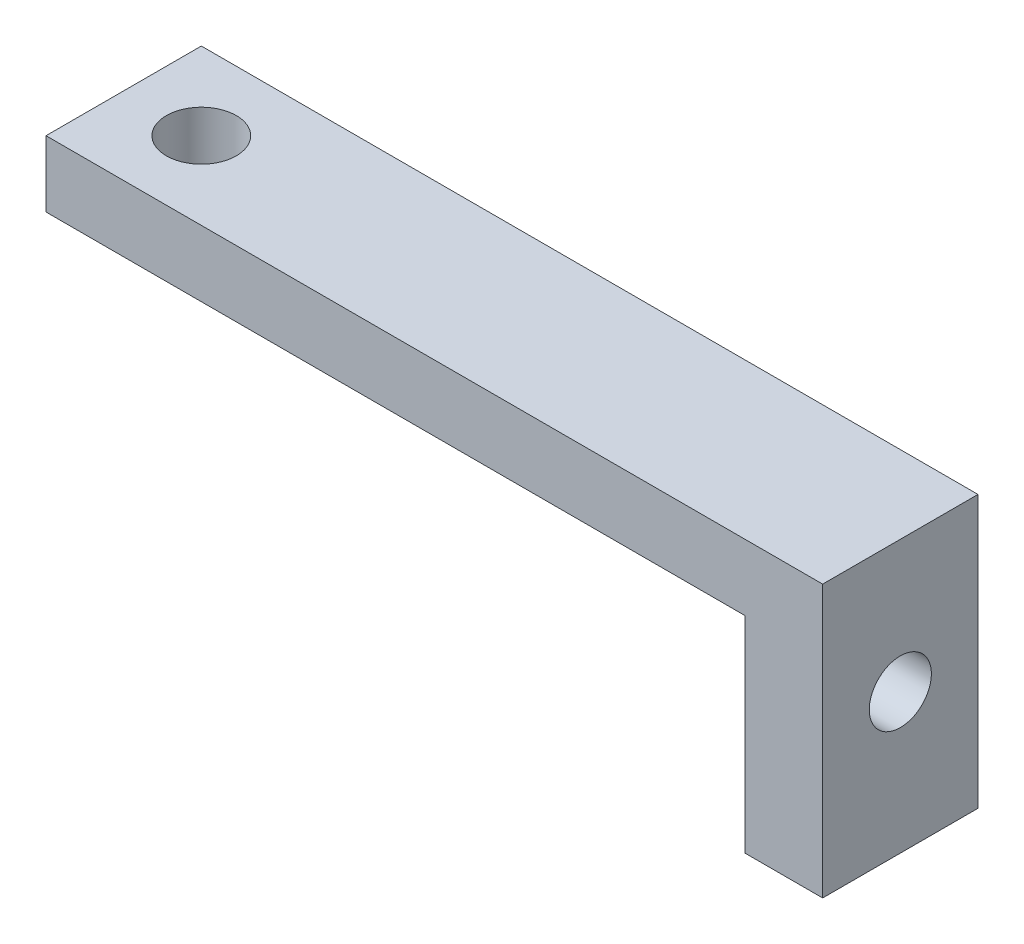
ISO-10303-21;
HEADER;
FILE_DESCRIPTION(('STEP AP214'),'2;1');
FILE_NAME('part.step','',(''),(''),'','','');
FILE_SCHEMA(('AUTOMOTIVE_DESIGN { 1 0 10303 214 1 1 1 1 }'));
ENDSEC;
DATA;
#1=APPLICATION_CONTEXT('core data for automotive mechanical design processes');
#2=APPLICATION_PROTOCOL_DEFINITION('international standard','automotive_design',2000,#1);
#3=PRODUCT_CONTEXT('',#1,'mechanical');
#4=PRODUCT('Part','Part','',(#3));
#5=PRODUCT_RELATED_PRODUCT_CATEGORY('part','',(#4));
#6=PRODUCT_DEFINITION_FORMATION('','',#4);
#7=PRODUCT_DEFINITION_CONTEXT('part definition',#1,'design');
#8=PRODUCT_DEFINITION('design','',#6,#7);
#9=PRODUCT_DEFINITION_SHAPE('','',#8);
#10=(LENGTH_UNIT() NAMED_UNIT(*) SI_UNIT(.MILLI.,.METRE.));
#11=(NAMED_UNIT(*) PLANE_ANGLE_UNIT() SI_UNIT($,.RADIAN.));
#12=(NAMED_UNIT(*) SI_UNIT($,.STERADIAN.) SOLID_ANGLE_UNIT());
#13=UNCERTAINTY_MEASURE_WITH_UNIT(LENGTH_MEASURE(1.E-05),#10,'distance_accuracy_value','');
#14=(GEOMETRIC_REPRESENTATION_CONTEXT(3) GLOBAL_UNCERTAINTY_ASSIGNED_CONTEXT((#13)) GLOBAL_UNIT_ASSIGNED_CONTEXT((#10,
#11,#12)) REPRESENTATION_CONTEXT('',''));
#15=CARTESIAN_POINT('',(0.,0.,0.));
#16=DIRECTION('',(0.,0.,1.));
#17=DIRECTION('',(1.,0.,0.));
#18=AXIS2_PLACEMENT_3D('',#15,#16,#17);
#19=CARTESIAN_POINT('',(-50.5210624469207,-19.3001516616229,5.08));
#20=DIRECTION('',(0.,-1.,0.));
#21=DIRECTION('',(0.,0.,-1.));
#22=AXIS2_PLACEMENT_3D('',#19,#20,#21);
#23=PLANE('',#22);
#24=DIRECTION('',(-1.,0.,0.));
#25=VECTOR('',#24,1.);
#26=CARTESIAN_POINT('',(-50.5210624469207,-19.3001516616229,0.));
#27=LINE('',#26,#25);
#28=CARTESIAN_POINT('',(-50.5210624469207,-19.3001516616229,0.));
#29=VERTEX_POINT('',#28);
#30=CARTESIAN_POINT('',(-53.0610624469207,-19.3001516616229,0.));
#31=VERTEX_POINT('',#30);
#32=EDGE_CURVE('E131',#29,#31,#27,.T.);
#33=ORIENTED_EDGE('',*,*,#32,.F.);
#34=DIRECTION('',(0.,0.,-1.));
#35=VECTOR('',#34,1.);
#36=CARTESIAN_POINT('',(-50.5210624469207,-19.3001516616229,5.08));
#37=LINE('',#36,#35);
#38=CARTESIAN_POINT('',(-50.5210624469207,-19.3001516616229,5.08));
#39=VERTEX_POINT('',#38);
#40=EDGE_CURVE('E11',#39,#29,#37,.T.);
#41=ORIENTED_EDGE('',*,*,#40,.F.);
#42=DIRECTION('',(-1.,0.,0.));
#43=VECTOR('',#42,1.);
#44=CARTESIAN_POINT('',(-50.5210624469207,-19.3001516616229,5.08));
#45=LINE('',#44,#43);
#46=CARTESIAN_POINT('',(-53.0610624469207,-19.3001516616229,5.08));
#47=VERTEX_POINT('',#46);
#48=EDGE_CURVE('E152',#39,#47,#45,.T.);
#49=ORIENTED_EDGE('',*,*,#48,.T.);
#50=DIRECTION('',(0.,0.,-1.));
#51=VECTOR('',#50,1.);
#52=CARTESIAN_POINT('',(-53.0610624469207,-19.3001516616229,5.08));
#53=LINE('',#52,#51);
#54=EDGE_CURVE('E90',#47,#31,#53,.T.);
#55=ORIENTED_EDGE('',*,*,#54,.T.);
#56=EDGE_LOOP('',(#33,#41,#49,#55));
#57=FACE_BOUND('',#56,.T.);
#58=ADVANCED_FACE('F39',(#57),#23,.T.);
#59=CARTESIAN_POINT('',(-50.5210624469207,-10.4101516616229,5.08));
#60=DIRECTION('',(1.,0.,0.));
#61=DIRECTION('',(0.,0.,-1.));
#62=AXIS2_PLACEMENT_3D('',#59,#60,#61);
#63=PLANE('',#62);
#64=CARTESIAN_POINT('',(-50.5210624469207,-14.7281516616229,2.54));
#65=DIRECTION('',(1.,0.,0.));
#66=DIRECTION('',(0.,0.,-1.));
#67=AXIS2_PLACEMENT_3D('',#64,#65,#66);
#68=CIRCLE('',#67,1.016);
#69=CARTESIAN_POINT('',(-50.5210624469207,-14.7281516616229,1.524));
#70=VERTEX_POINT('',#69);
#71=EDGE_CURVE('E174',#70,#70,#68,.T.);
#72=ORIENTED_EDGE('',*,*,#71,.F.);
#73=EDGE_LOOP('',(#72));
#74=FACE_BOUND('',#73,.T.);
#75=DIRECTION('',(0.,-1.,0.));
#76=VECTOR('',#75,1.);
#77=CARTESIAN_POINT('',(-50.5210624469207,-10.4101516616229,0.));
#78=LINE('',#77,#76);
#79=CARTESIAN_POINT('',(-50.5210624469207,-10.4101516616229,0.));
#80=VERTEX_POINT('',#79);
#81=EDGE_CURVE('E149',#80,#29,#78,.T.);
#82=ORIENTED_EDGE('',*,*,#81,.F.);
#83=DIRECTION('',(0.,0.,-1.));
#84=VECTOR('',#83,1.);
#85=CARTESIAN_POINT('',(-50.5210624469207,-10.4101516616229,5.08));
#86=LINE('',#85,#84);
#87=CARTESIAN_POINT('',(-50.5210624469207,-10.4101516616229,5.08));
#88=VERTEX_POINT('',#87);
#89=EDGE_CURVE('E49',#88,#80,#86,.T.);
#90=ORIENTED_EDGE('',*,*,#89,.F.);
#91=DIRECTION('',(0.,-1.,0.));
#92=VECTOR('',#91,1.);
#93=CARTESIAN_POINT('',(-50.5210624469207,-10.4101516616229,5.08));
#94=LINE('',#93,#92);
#95=EDGE_CURVE('E117',#88,#39,#94,.T.);
#96=ORIENTED_EDGE('',*,*,#95,.T.);
#97=ORIENTED_EDGE('',*,*,#40,.T.);
#98=EDGE_LOOP('',(#82,#90,#96,#97));
#99=FACE_BOUND('',#98,.T.);
#100=ADVANCED_FACE('F183',(#74,#99),#63,.T.);
#101=CARTESIAN_POINT('',(-75.9210624469206,-10.4101516616229,5.08));
#102=DIRECTION('',(0.,1.,0.));
#103=DIRECTION('',(0.,0.,1.));
#104=AXIS2_PLACEMENT_3D('',#101,#102,#103);
#105=PLANE('',#104);
#106=CARTESIAN_POINT('',(-73.3810624469207,-10.4101516616229,2.54));
#107=DIRECTION('',(0.,1.,0.));
#108=DIRECTION('',(0.,0.,1.));
#109=AXIS2_PLACEMENT_3D('',#106,#107,#108);
#110=CIRCLE('',#109,1.14299999999999);
#111=CARTESIAN_POINT('',(-73.3810624469207,-10.4101516616229,3.68299999999999));
#112=VERTEX_POINT('',#111);
#113=EDGE_CURVE('E164',#112,#112,#110,.T.);
#114=ORIENTED_EDGE('',*,*,#113,.F.);
#115=EDGE_LOOP('',(#114));
#116=FACE_BOUND('',#115,.T.);
#117=DIRECTION('',(1.,0.,0.));
#118=VECTOR('',#117,1.);
#119=CARTESIAN_POINT('',(-75.9210624469206,-10.4101516616229,0.));
#120=LINE('',#119,#118);
#121=CARTESIAN_POINT('',(-75.9210624469206,-10.4101516616229,0.));
#122=VERTEX_POINT('',#121);
#123=EDGE_CURVE('E103',#122,#80,#120,.T.);
#124=ORIENTED_EDGE('',*,*,#123,.F.);
#125=DIRECTION('',(0.,0.,-1.));
#126=VECTOR('',#125,1.);
#127=CARTESIAN_POINT('',(-75.9210624469206,-10.4101516616229,5.08));
#128=LINE('',#127,#126);
#129=CARTESIAN_POINT('',(-75.9210624469206,-10.4101516616229,5.08));
#130=VERTEX_POINT('',#129);
#131=EDGE_CURVE('E98',#130,#122,#128,.T.);
#132=ORIENTED_EDGE('',*,*,#131,.F.);
#133=DIRECTION('',(1.,0.,0.));
#134=VECTOR('',#133,1.);
#135=CARTESIAN_POINT('',(-75.9210624469206,-10.4101516616229,5.08));
#136=LINE('',#135,#134);
#137=EDGE_CURVE('E101',#130,#88,#136,.T.);
#138=ORIENTED_EDGE('',*,*,#137,.T.);
#139=ORIENTED_EDGE('',*,*,#89,.T.);
#140=EDGE_LOOP('',(#124,#132,#138,#139));
#141=FACE_BOUND('',#140,.T.);
#142=ADVANCED_FACE('F100',(#116,#141),#105,.T.);
#143=CARTESIAN_POINT('',(-75.9210624469206,-12.5720765147948,5.08));
#144=DIRECTION('',(-1.,0.,0.));
#145=DIRECTION('',(0.,0.,1.));
#146=AXIS2_PLACEMENT_3D('',#143,#144,#145);
#147=PLANE('',#146);
#148=DIRECTION('',(0.,1.,0.));
#149=VECTOR('',#148,1.);
#150=CARTESIAN_POINT('',(-75.9210624469206,-12.5720765147948,0.));
#151=LINE('',#150,#149);
#152=CARTESIAN_POINT('',(-75.9210624469206,-12.5720765147948,0.));
#153=VERTEX_POINT('',#152);
#154=EDGE_CURVE('E144',#153,#122,#151,.T.);
#155=ORIENTED_EDGE('',*,*,#154,.F.);
#156=DIRECTION('',(0.,0.,-1.));
#157=VECTOR('',#156,1.);
#158=CARTESIAN_POINT('',(-75.9210624469206,-12.5720765147948,5.08));
#159=LINE('',#158,#157);
#160=CARTESIAN_POINT('',(-75.9210624469206,-12.5720765147948,5.08));
#161=VERTEX_POINT('',#160);
#162=EDGE_CURVE('E109',#161,#153,#159,.T.);
#163=ORIENTED_EDGE('',*,*,#162,.F.);
#164=DIRECTION('',(0.,1.,0.));
#165=VECTOR('',#164,1.);
#166=CARTESIAN_POINT('',(-75.9210624469206,-12.5720765147948,5.08));
#167=LINE('',#166,#165);
#168=EDGE_CURVE('E115',#161,#130,#167,.T.);
#169=ORIENTED_EDGE('',*,*,#168,.T.);
#170=ORIENTED_EDGE('',*,*,#131,.T.);
#171=EDGE_LOOP('',(#155,#163,#169,#170));
#172=FACE_BOUND('',#171,.T.);
#173=ADVANCED_FACE('F120',(#172),#147,.T.);
#174=CARTESIAN_POINT('',(-53.0610624469207,-12.5720765147948,5.08));
#175=DIRECTION('',(0.,-1.,0.));
#176=DIRECTION('',(1.,0.,0.));
#177=AXIS2_PLACEMENT_3D('',#174,#175,#176);
#178=PLANE('',#177);
#179=CARTESIAN_POINT('',(-73.3810624469207,-12.5720765147948,2.54));
#180=DIRECTION('',(0.,-1.,0.));
#181=DIRECTION('',(1.,0.,0.));
#182=AXIS2_PLACEMENT_3D('',#179,#180,#181);
#183=CIRCLE('',#182,1.14299999999999);
#184=CARTESIAN_POINT('',(-72.2380624469207,-12.5720765147948,2.54));
#185=VERTEX_POINT('',#184);
#186=EDGE_CURVE('E136',#185,#185,#183,.T.);
#187=ORIENTED_EDGE('',*,*,#186,.F.);
#188=EDGE_LOOP('',(#187));
#189=FACE_BOUND('',#188,.T.);
#190=DIRECTION('',(-1.,0.,0.));
#191=VECTOR('',#190,1.);
#192=CARTESIAN_POINT('',(-53.0610624469207,-12.5720765147948,0.));
#193=LINE('',#192,#191);
#194=CARTESIAN_POINT('',(-53.0610624469207,-12.5720765147948,0.));
#195=VERTEX_POINT('',#194);
#196=EDGE_CURVE('E140',#195,#153,#193,.T.);
#197=ORIENTED_EDGE('',*,*,#196,.F.);
#198=DIRECTION('',(0.,0.,-1.));
#199=VECTOR('',#198,1.);
#200=CARTESIAN_POINT('',(-53.0610624469207,-12.5720765147948,5.08));
#201=LINE('',#200,#199);
#202=CARTESIAN_POINT('',(-53.0610624469207,-12.5720765147948,5.08));
#203=VERTEX_POINT('',#202);
#204=EDGE_CURVE('E158',#203,#195,#201,.T.);
#205=ORIENTED_EDGE('',*,*,#204,.F.);
#206=DIRECTION('',(-1.,0.,0.));
#207=VECTOR('',#206,1.);
#208=CARTESIAN_POINT('',(-53.0610624469207,-12.5720765147948,5.08));
#209=LINE('',#208,#207);
#210=EDGE_CURVE('E122',#203,#161,#209,.T.);
#211=ORIENTED_EDGE('',*,*,#210,.T.);
#212=ORIENTED_EDGE('',*,*,#162,.T.);
#213=EDGE_LOOP('',(#197,#205,#211,#212));
#214=FACE_BOUND('',#213,.T.);
#215=ADVANCED_FACE('F199',(#189,#214),#178,.T.);
#216=CARTESIAN_POINT('',(-53.0610624469207,-19.3001516616229,5.08));
#217=DIRECTION('',(-1.,0.,0.));
#218=DIRECTION('',(0.,-1.,0.));
#219=AXIS2_PLACEMENT_3D('',#216,#217,#218);
#220=PLANE('',#219);
#221=CARTESIAN_POINT('',(-53.0610624469207,-14.7281516616229,2.54));
#222=DIRECTION('',(-1.,0.,0.));
#223=DIRECTION('',(0.,-1.,0.));
#224=AXIS2_PLACEMENT_3D('',#221,#222,#223);
#225=CIRCLE('',#224,1.016);
#226=CARTESIAN_POINT('',(-53.0610624469207,-15.7441516616229,2.54));
#227=VERTEX_POINT('',#226);
#228=EDGE_CURVE('E42',#227,#227,#225,.T.);
#229=ORIENTED_EDGE('',*,*,#228,.F.);
#230=EDGE_LOOP('',(#229));
#231=FACE_BOUND('',#230,.T.);
#232=DIRECTION('',(0.,1.,0.));
#233=VECTOR('',#232,1.);
#234=CARTESIAN_POINT('',(-53.0610624469207,-19.3001516616229,0.));
#235=LINE('',#234,#233);
#236=EDGE_CURVE('E135',#31,#195,#235,.T.);
#237=ORIENTED_EDGE('',*,*,#236,.F.);
#238=ORIENTED_EDGE('',*,*,#54,.F.);
#239=DIRECTION('',(0.,1.,0.));
#240=VECTOR('',#239,1.);
#241=CARTESIAN_POINT('',(-53.0610624469207,-19.3001516616229,5.08));
#242=LINE('',#241,#240);
#243=EDGE_CURVE('E125',#47,#203,#242,.T.);
#244=ORIENTED_EDGE('',*,*,#243,.T.);
#245=ORIENTED_EDGE('',*,*,#204,.T.);
#246=EDGE_LOOP('',(#237,#238,#244,#245));
#247=FACE_BOUND('',#246,.T.);
#248=ADVANCED_FACE('F179',(#231,#247),#220,.T.);
#249=CARTESIAN_POINT('',(0.,0.,5.08));
#250=DIRECTION('',(0.,0.,-1.));
#251=DIRECTION('',(-1.,0.,0.));
#252=AXIS2_PLACEMENT_3D('',#249,#250,#251);
#253=PLANE('',#252);
#254=ORIENTED_EDGE('',*,*,#48,.F.);
#255=ORIENTED_EDGE('',*,*,#95,.F.);
#256=ORIENTED_EDGE('',*,*,#137,.F.);
#257=ORIENTED_EDGE('',*,*,#168,.F.);
#258=ORIENTED_EDGE('',*,*,#210,.F.);
#259=ORIENTED_EDGE('',*,*,#243,.F.);
#260=EDGE_LOOP('',(#254,#255,#256,#257,#258,#259));
#261=FACE_BOUND('',#260,.T.);
#262=ADVANCED_FACE('F113',(#261),#253,.F.);
#263=CARTESIAN_POINT('',(0.,0.,0.));
#264=DIRECTION('',(0.,0.,-1.));
#265=DIRECTION('',(-1.,0.,0.));
#266=AXIS2_PLACEMENT_3D('',#263,#264,#265);
#267=PLANE('',#266);
#268=ORIENTED_EDGE('',*,*,#32,.T.);
#269=ORIENTED_EDGE('',*,*,#236,.T.);
#270=ORIENTED_EDGE('',*,*,#196,.T.);
#271=ORIENTED_EDGE('',*,*,#154,.T.);
#272=ORIENTED_EDGE('',*,*,#123,.T.);
#273=ORIENTED_EDGE('',*,*,#81,.T.);
#274=EDGE_LOOP('',(#268,#269,#270,#271,#272,#273));
#275=FACE_BOUND('',#274,.T.);
#276=ADVANCED_FACE('F182',(#275),#267,.T.);
#277=CARTESIAN_POINT('',(-73.3810624469207,-15.4901516616229,2.54));
#278=DIRECTION('',(0.,1.,0.));
#279=DIRECTION('',(0.,0.,1.));
#280=AXIS2_PLACEMENT_3D('',#277,#278,#279);
#281=CYLINDRICAL_SURFACE('',#280,1.14299999999999);
#282=ORIENTED_EDGE('',*,*,#186,.T.);
#283=EDGE_LOOP('',(#282));
#284=FACE_BOUND('',#283,.T.);
#285=ORIENTED_EDGE('',*,*,#113,.T.);
#286=EDGE_LOOP('',(#285));
#287=FACE_BOUND('',#286,.T.);
#288=ADVANCED_FACE('F212',(#284,#287),#281,.F.);
#289=CARTESIAN_POINT('',(-55.6010624469207,-14.7281516616229,2.54));
#290=DIRECTION('',(1.,0.,0.));
#291=DIRECTION('',(0.,0.,-1.));
#292=AXIS2_PLACEMENT_3D('',#289,#290,#291);
#293=CYLINDRICAL_SURFACE('',#292,1.016);
#294=ORIENTED_EDGE('',*,*,#228,.T.);
#295=EDGE_LOOP('',(#294));
#296=FACE_BOUND('',#295,.T.);
#297=ORIENTED_EDGE('',*,*,#71,.T.);
#298=EDGE_LOOP('',(#297));
#299=FACE_BOUND('',#298,.T.);
#300=ADVANCED_FACE('F209',(#296,#299),#293,.F.);
#301=CLOSED_SHELL('',(#58,#100,#142,#173,#215,#248,#262,#276,#288,#300));
#302=MANIFOLD_SOLID_BREP('B2',#301);
#303=ADVANCED_BREP_SHAPE_REPRESENTATION('',(#18,#302),#14);
#304=SHAPE_DEFINITION_REPRESENTATION(#9,#303);
ENDSEC;
END-ISO-10303-21;
